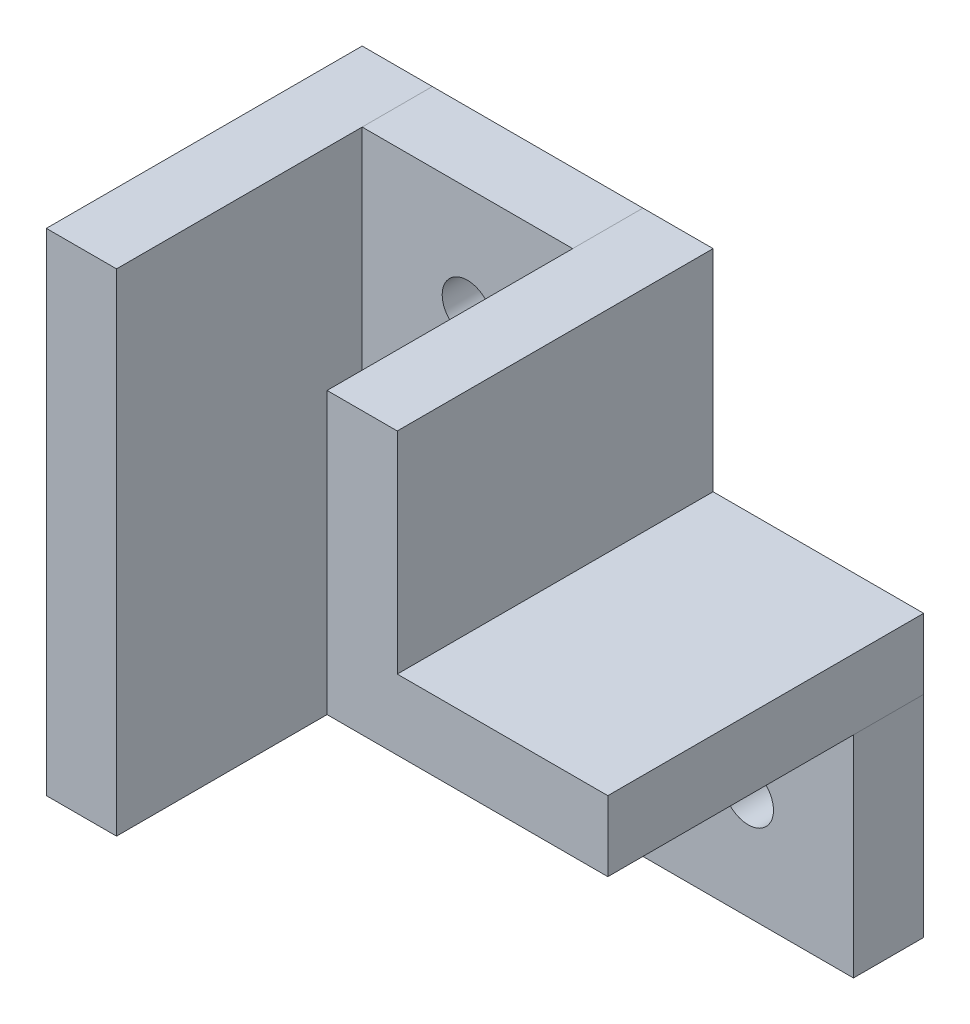
ISO-10303-21;
HEADER;
FILE_DESCRIPTION(('STEP AP214'),'2;1');
FILE_NAME('part.step','',(''),(''),'','','');
FILE_SCHEMA(('AUTOMOTIVE_DESIGN { 1 0 10303 214 1 1 1 1 }'));
ENDSEC;
DATA;
#1=APPLICATION_CONTEXT('core data for automotive mechanical design processes');
#2=APPLICATION_PROTOCOL_DEFINITION('international standard','automotive_design',2000,#1);
#3=PRODUCT_CONTEXT('',#1,'mechanical');
#4=PRODUCT('Part','Part','',(#3));
#5=PRODUCT_RELATED_PRODUCT_CATEGORY('part','',(#4));
#6=PRODUCT_DEFINITION_FORMATION('','',#4);
#7=PRODUCT_DEFINITION_CONTEXT('part definition',#1,'design');
#8=PRODUCT_DEFINITION('design','',#6,#7);
#9=PRODUCT_DEFINITION_SHAPE('','',#8);
#10=(LENGTH_UNIT() NAMED_UNIT(*) SI_UNIT(.MILLI.,.METRE.));
#11=(NAMED_UNIT(*) PLANE_ANGLE_UNIT() SI_UNIT($,.RADIAN.));
#12=(NAMED_UNIT(*) SI_UNIT($,.STERADIAN.) SOLID_ANGLE_UNIT());
#13=UNCERTAINTY_MEASURE_WITH_UNIT(LENGTH_MEASURE(1.E-05),#10,'distance_accuracy_value','');
#14=(GEOMETRIC_REPRESENTATION_CONTEXT(3) GLOBAL_UNCERTAINTY_ASSIGNED_CONTEXT((#13)) GLOBAL_UNIT_ASSIGNED_CONTEXT((#10,
#11,#12)) REPRESENTATION_CONTEXT('',''));
#15=CARTESIAN_POINT('',(0.,0.,0.));
#16=DIRECTION('',(0.,0.,1.));
#17=DIRECTION('',(1.,0.,0.));
#18=AXIS2_PLACEMENT_3D('',#15,#16,#17);
#19=CARTESIAN_POINT('',(-7.52988047808764,-25.8067729083665,22.5));
#20=DIRECTION('',(1.,0.,0.));
#21=DIRECTION('',(0.,1.,0.));
#22=AXIS2_PLACEMENT_3D('',#19,#20,#21);
#23=PLANE('',#22);
#24=DIRECTION('',(0.,-1.,0.));
#25=VECTOR('',#24,1.);
#26=CARTESIAN_POINT('',(-7.52988047808764,-25.8067729083665,0.));
#27=LINE('',#26,#25);
#28=CARTESIAN_POINT('',(-7.52988047808764,9.19322709163348,0.));
#29=VERTEX_POINT('',#28);
#30=CARTESIAN_POINT('',(-7.52988047808764,-25.8067729083665,0.));
#31=VERTEX_POINT('',#30);
#32=EDGE_CURVE('E110',#29,#31,#27,.T.);
#33=ORIENTED_EDGE('',*,*,#32,.F.);
#34=DIRECTION('',(0.,0.,-1.));
#35=VECTOR('',#34,1.);
#36=CARTESIAN_POINT('',(-7.52988047808764,9.19322709163348,22.5));
#37=LINE('',#36,#35);
#38=CARTESIAN_POINT('',(-7.52988047808764,9.19322709163348,22.5));
#39=VERTEX_POINT('',#38);
#40=EDGE_CURVE('E12',#39,#29,#37,.T.);
#41=ORIENTED_EDGE('',*,*,#40,.F.);
#42=DIRECTION('',(0.,-1.,0.));
#43=VECTOR('',#42,1.);
#44=CARTESIAN_POINT('',(-7.52988047808764,-25.8067729083665,22.5));
#45=LINE('',#44,#43);
#46=CARTESIAN_POINT('',(-7.52988047808764,-25.8067729083665,22.5));
#47=VERTEX_POINT('',#46);
#48=EDGE_CURVE('E104',#39,#47,#45,.T.);
#49=ORIENTED_EDGE('',*,*,#48,.T.);
#50=DIRECTION('',(0.,0.,-1.));
#51=VECTOR('',#50,1.);
#52=CARTESIAN_POINT('',(-7.52988047808764,-25.8067729083665,22.5));
#53=LINE('',#52,#51);
#54=EDGE_CURVE('E49',#47,#31,#53,.T.);
#55=ORIENTED_EDGE('',*,*,#54,.T.);
#56=EDGE_LOOP('',(#33,#41,#49,#55));
#57=FACE_BOUND('',#56,.T.);
#58=ADVANCED_FACE('F46',(#57),#23,.T.);
#59=CARTESIAN_POINT('',(-7.52988047808764,9.19322709163348,22.5));
#60=DIRECTION('',(0.,1.,0.));
#61=DIRECTION('',(0.,0.,1.));
#62=AXIS2_PLACEMENT_3D('',#59,#60,#61);
#63=PLANE('',#62);
#64=DIRECTION('',(1.,0.,0.));
#65=VECTOR('',#64,1.);
#66=CARTESIAN_POINT('',(-7.52988047808764,9.19322709163348,0.));
#67=LINE('',#66,#65);
#68=CARTESIAN_POINT('',(-12.5298804780876,9.19322709163348,0.));
#69=VERTEX_POINT('',#68);
#70=EDGE_CURVE('E106',#69,#29,#67,.T.);
#71=ORIENTED_EDGE('',*,*,#70,.F.);
#72=DIRECTION('',(0.,0.,-1.));
#73=VECTOR('',#72,1.);
#74=CARTESIAN_POINT('',(-12.5298804780876,9.19322709163348,22.5));
#75=LINE('',#74,#73);
#76=CARTESIAN_POINT('',(-12.5298804780876,9.19322709163348,22.5));
#77=VERTEX_POINT('',#76);
#78=EDGE_CURVE('E55',#77,#69,#75,.T.);
#79=ORIENTED_EDGE('',*,*,#78,.F.);
#80=DIRECTION('',(1.,0.,0.));
#81=VECTOR('',#80,1.);
#82=CARTESIAN_POINT('',(-7.52988047808764,9.19322709163348,22.5));
#83=LINE('',#82,#81);
#84=EDGE_CURVE('E101',#77,#39,#83,.T.);
#85=ORIENTED_EDGE('',*,*,#84,.T.);
#86=ORIENTED_EDGE('',*,*,#40,.T.);
#87=EDGE_LOOP('',(#71,#79,#85,#86));
#88=FACE_BOUND('',#87,.T.);
#89=ADVANCED_FACE('F120',(#88),#63,.T.);
#90=CARTESIAN_POINT('',(-12.5298804780876,-25.8067729083665,22.5));
#91=DIRECTION('',(-1.,0.,0.));
#92=DIRECTION('',(0.,0.,1.));
#93=AXIS2_PLACEMENT_3D('',#90,#91,#92);
#94=PLANE('',#93);
#95=DIRECTION('',(0.,1.,0.));
#96=VECTOR('',#95,1.);
#97=CARTESIAN_POINT('',(-12.5298804780876,-25.8067729083665,0.));
#98=LINE('',#97,#96);
#99=CARTESIAN_POINT('',(-12.5298804780876,-25.8067729083665,0.));
#100=VERTEX_POINT('',#99);
#101=EDGE_CURVE('E96',#100,#69,#98,.T.);
#102=ORIENTED_EDGE('',*,*,#101,.F.);
#103=DIRECTION('',(0.,0.,-1.));
#104=VECTOR('',#103,1.);
#105=CARTESIAN_POINT('',(-12.5298804780876,-25.8067729083665,22.5));
#106=LINE('',#105,#104);
#107=CARTESIAN_POINT('',(-12.5298804780876,-25.8067729083665,22.5));
#108=VERTEX_POINT('',#107);
#109=EDGE_CURVE('E91',#108,#100,#106,.T.);
#110=ORIENTED_EDGE('',*,*,#109,.F.);
#111=DIRECTION('',(0.,1.,0.));
#112=VECTOR('',#111,1.);
#113=CARTESIAN_POINT('',(-12.5298804780876,-25.8067729083665,22.5));
#114=LINE('',#113,#112);
#115=EDGE_CURVE('E94',#108,#77,#114,.T.);
#116=ORIENTED_EDGE('',*,*,#115,.T.);
#117=ORIENTED_EDGE('',*,*,#78,.T.);
#118=EDGE_LOOP('',(#102,#110,#116,#117));
#119=FACE_BOUND('',#118,.T.);
#120=ADVANCED_FACE('F93',(#119),#94,.T.);
#121=CARTESIAN_POINT('',(-7.52988047808764,-25.8067729083665,22.5));
#122=DIRECTION('',(0.,-1.,0.));
#123=DIRECTION('',(0.,0.,-1.));
#124=AXIS2_PLACEMENT_3D('',#121,#122,#123);
#125=PLANE('',#124);
#126=DIRECTION('',(-1.,0.,0.));
#127=VECTOR('',#126,1.);
#128=CARTESIAN_POINT('',(-7.52988047808764,-25.8067729083665,0.));
#129=LINE('',#128,#127);
#130=EDGE_CURVE('E113',#31,#100,#129,.T.);
#131=ORIENTED_EDGE('',*,*,#130,.F.);
#132=ORIENTED_EDGE('',*,*,#54,.F.);
#133=DIRECTION('',(-1.,0.,0.));
#134=VECTOR('',#133,1.);
#135=CARTESIAN_POINT('',(-7.52988047808764,-25.8067729083665,22.5));
#136=LINE('',#135,#134);
#137=EDGE_CURVE('E100',#47,#108,#136,.T.);
#138=ORIENTED_EDGE('',*,*,#137,.T.);
#139=ORIENTED_EDGE('',*,*,#109,.T.);
#140=EDGE_LOOP('',(#131,#132,#138,#139));
#141=FACE_BOUND('',#140,.T.);
#142=ADVANCED_FACE('F103',(#141),#125,.T.);
#143=CARTESIAN_POINT('',(0.,0.,22.5));
#144=DIRECTION('',(0.,0.,1.));
#145=DIRECTION('',(1.,0.,0.));
#146=AXIS2_PLACEMENT_3D('',#143,#144,#145);
#147=PLANE('',#146);
#148=ORIENTED_EDGE('',*,*,#48,.F.);
#149=ORIENTED_EDGE('',*,*,#84,.F.);
#150=ORIENTED_EDGE('',*,*,#115,.F.);
#151=ORIENTED_EDGE('',*,*,#137,.F.);
#152=EDGE_LOOP('',(#148,#149,#150,#151));
#153=FACE_BOUND('',#152,.T.);
#154=ADVANCED_FACE('F99',(#153),#147,.T.);
#155=CARTESIAN_POINT('',(0.,0.,0.));
#156=DIRECTION('',(0.,0.,1.));
#157=DIRECTION('',(1.,0.,0.));
#158=AXIS2_PLACEMENT_3D('',#155,#156,#157);
#159=PLANE('',#158);
#160=ORIENTED_EDGE('',*,*,#32,.T.);
#161=ORIENTED_EDGE('',*,*,#130,.T.);
#162=ORIENTED_EDGE('',*,*,#101,.T.);
#163=ORIENTED_EDGE('',*,*,#70,.T.);
#164=EDGE_LOOP('',(#160,#161,#162,#163));
#165=FACE_BOUND('',#164,.T.);
#166=ADVANCED_FACE('F119',(#165),#159,.F.);
#167=CLOSED_SHELL('',(#58,#89,#120,#142,#154,#166));
#168=MANIFOLD_SOLID_BREP('B2',#167);
#169=CARTESIAN_POINT('',(7.47011952191236,-10.8067729083665,22.5));
#170=DIRECTION('',(-1.,0.,0.));
#171=DIRECTION('',(0.,-1.,0.));
#172=AXIS2_PLACEMENT_3D('',#169,#170,#171);
#173=PLANE('',#172);
#174=DIRECTION('',(0.,1.,0.));
#175=VECTOR('',#174,1.);
#176=CARTESIAN_POINT('',(7.47011952191236,-10.8067729083665,0.));
#177=LINE('',#176,#175);
#178=CARTESIAN_POINT('',(7.47011952191236,-10.8067729083665,0.));
#179=VERTEX_POINT('',#178);
#180=CARTESIAN_POINT('',(7.47011952191236,9.19322709163348,0.));
#181=VERTEX_POINT('',#180);
#182=EDGE_CURVE('E264',#179,#181,#177,.T.);
#183=ORIENTED_EDGE('',*,*,#182,.F.);
#184=DIRECTION('',(0.,0.,-1.));
#185=VECTOR('',#184,1.);
#186=CARTESIAN_POINT('',(7.47011952191236,-10.8067729083665,22.5));
#187=LINE('',#186,#185);
#188=CARTESIAN_POINT('',(7.47011952191236,-10.8067729083665,22.5));
#189=VERTEX_POINT('',#188);
#190=EDGE_CURVE('E44',#189,#179,#187,.T.);
#191=ORIENTED_EDGE('',*,*,#190,.F.);
#192=DIRECTION('',(0.,1.,0.));
#193=VECTOR('',#192,1.);
#194=CARTESIAN_POINT('',(7.47011952191236,-10.8067729083665,22.5));
#195=LINE('',#194,#193);
#196=CARTESIAN_POINT('',(7.47011952191236,9.19322709163348,22.5));
#197=VERTEX_POINT('',#196);
#198=EDGE_CURVE('E278',#189,#197,#195,.T.);
#199=ORIENTED_EDGE('',*,*,#198,.T.);
#200=DIRECTION('',(0.,0.,-1.));
#201=VECTOR('',#200,1.);
#202=CARTESIAN_POINT('',(7.47011952191236,9.19322709163348,22.5));
#203=LINE('',#202,#201);
#204=EDGE_CURVE('E182',#197,#181,#203,.T.);
#205=ORIENTED_EDGE('',*,*,#204,.T.);
#206=EDGE_LOOP('',(#183,#191,#199,#205));
#207=FACE_BOUND('',#206,.T.);
#208=ADVANCED_FACE('F179',(#207),#173,.T.);
#209=CARTESIAN_POINT('',(27.4701195219124,-10.8067729083665,22.5));
#210=DIRECTION('',(0.,-1.,0.));
#211=DIRECTION('',(1.,0.,0.));
#212=AXIS2_PLACEMENT_3D('',#209,#210,#211);
#213=PLANE('',#212);
#214=DIRECTION('',(-1.,0.,0.));
#215=VECTOR('',#214,1.);
#216=CARTESIAN_POINT('',(27.4701195219124,-10.8067729083665,0.));
#217=LINE('',#216,#215);
#218=CARTESIAN_POINT('',(27.4701195219124,-10.8067729083665,0.));
#219=VERTEX_POINT('',#218);
#220=EDGE_CURVE('E276',#219,#179,#217,.T.);
#221=ORIENTED_EDGE('',*,*,#220,.F.);
#222=DIRECTION('',(0.,0.,-1.));
#223=VECTOR('',#222,1.);
#224=CARTESIAN_POINT('',(27.4701195219124,-10.8067729083665,22.5));
#225=LINE('',#224,#223);
#226=CARTESIAN_POINT('',(27.4701195219124,-10.8067729083665,22.5));
#227=VERTEX_POINT('',#226);
#228=EDGE_CURVE('E188',#227,#219,#225,.T.);
#229=ORIENTED_EDGE('',*,*,#228,.F.);
#230=DIRECTION('',(-1.,0.,0.));
#231=VECTOR('',#230,1.);
#232=CARTESIAN_POINT('',(27.4701195219124,-10.8067729083665,22.5));
#233=LINE('',#232,#231);
#234=EDGE_CURVE('E254',#227,#189,#233,.T.);
#235=ORIENTED_EDGE('',*,*,#234,.T.);
#236=ORIENTED_EDGE('',*,*,#190,.T.);
#237=EDGE_LOOP('',(#221,#229,#235,#236));
#238=FACE_BOUND('',#237,.T.);
#239=ADVANCED_FACE('F286',(#238),#213,.T.);
#240=CARTESIAN_POINT('',(27.4701195219124,-10.8067729083665,22.5));
#241=DIRECTION('',(1.,0.,0.));
#242=DIRECTION('',(0.,0.,-1.));
#243=AXIS2_PLACEMENT_3D('',#240,#241,#242);
#244=PLANE('',#243);
#245=DIRECTION('',(0.,-1.,0.));
#246=VECTOR('',#245,1.);
#247=CARTESIAN_POINT('',(27.4701195219124,-10.8067729083665,0.));
#248=LINE('',#247,#246);
#249=CARTESIAN_POINT('',(27.4701195219124,-5.80677290836653,0.));
#250=VERTEX_POINT('',#249);
#251=EDGE_CURVE('E241',#250,#219,#248,.T.);
#252=ORIENTED_EDGE('',*,*,#251,.F.);
#253=DIRECTION('',(0.,0.,-1.));
#254=VECTOR('',#253,1.);
#255=CARTESIAN_POINT('',(27.4701195219124,-5.80677290836653,22.5));
#256=LINE('',#255,#254);
#257=CARTESIAN_POINT('',(27.4701195219124,-5.80677290836653,22.5));
#258=VERTEX_POINT('',#257);
#259=EDGE_CURVE('E236',#258,#250,#256,.T.);
#260=ORIENTED_EDGE('',*,*,#259,.F.);
#261=DIRECTION('',(0.,-1.,0.));
#262=VECTOR('',#261,1.);
#263=CARTESIAN_POINT('',(27.4701195219124,-10.8067729083665,22.5));
#264=LINE('',#263,#262);
#265=EDGE_CURVE('E239',#258,#227,#264,.T.);
#266=ORIENTED_EDGE('',*,*,#265,.T.);
#267=ORIENTED_EDGE('',*,*,#228,.T.);
#268=EDGE_LOOP('',(#252,#260,#266,#267));
#269=FACE_BOUND('',#268,.T.);
#270=ADVANCED_FACE('F238',(#269),#244,.T.);
#271=CARTESIAN_POINT('',(12.4701195219124,-5.80677290836653,22.5));
#272=DIRECTION('',(0.,1.,0.));
#273=DIRECTION('',(-1.,0.,0.));
#274=AXIS2_PLACEMENT_3D('',#271,#272,#273);
#275=PLANE('',#274);
#276=DIRECTION('',(1.,0.,0.));
#277=VECTOR('',#276,1.);
#278=CARTESIAN_POINT('',(12.4701195219124,-5.80677290836653,0.));
#279=LINE('',#278,#277);
#280=CARTESIAN_POINT('',(12.4701195219124,-5.80677290836653,0.));
#281=VERTEX_POINT('',#280);
#282=EDGE_CURVE('E273',#281,#250,#279,.T.);
#283=ORIENTED_EDGE('',*,*,#282,.F.);
#284=DIRECTION('',(0.,0.,-1.));
#285=VECTOR('',#284,1.);
#286=CARTESIAN_POINT('',(12.4701195219124,-5.80677290836653,22.5));
#287=LINE('',#286,#285);
#288=CARTESIAN_POINT('',(12.4701195219124,-5.80677290836653,22.5));
#289=VERTEX_POINT('',#288);
#290=EDGE_CURVE('E246',#289,#281,#287,.T.);
#291=ORIENTED_EDGE('',*,*,#290,.F.);
#292=DIRECTION('',(1.,0.,0.));
#293=VECTOR('',#292,1.);
#294=CARTESIAN_POINT('',(12.4701195219124,-5.80677290836653,22.5));
#295=LINE('',#294,#293);
#296=EDGE_CURVE('E252',#289,#258,#295,.T.);
#297=ORIENTED_EDGE('',*,*,#296,.T.);
#298=ORIENTED_EDGE('',*,*,#259,.T.);
#299=EDGE_LOOP('',(#283,#291,#297,#298));
#300=FACE_BOUND('',#299,.T.);
#301=ADVANCED_FACE('F256',(#300),#275,.T.);
#302=CARTESIAN_POINT('',(12.4701195219124,9.19322709163348,22.5));
#303=DIRECTION('',(1.,0.,0.));
#304=DIRECTION('',(0.,1.,0.));
#305=AXIS2_PLACEMENT_3D('',#302,#303,#304);
#306=PLANE('',#305);
#307=DIRECTION('',(0.,-1.,0.));
#308=VECTOR('',#307,1.);
#309=CARTESIAN_POINT('',(12.4701195219124,9.19322709163348,0.));
#310=LINE('',#309,#308);
#311=CARTESIAN_POINT('',(12.4701195219124,9.19322709163348,0.));
#312=VERTEX_POINT('',#311);
#313=EDGE_CURVE('E270',#312,#281,#310,.T.);
#314=ORIENTED_EDGE('',*,*,#313,.F.);
#315=DIRECTION('',(0.,0.,-1.));
#316=VECTOR('',#315,1.);
#317=CARTESIAN_POINT('',(12.4701195219124,9.19322709163348,22.5));
#318=LINE('',#317,#316);
#319=CARTESIAN_POINT('',(12.4701195219124,9.19322709163348,22.5));
#320=VERTEX_POINT('',#319);
#321=EDGE_CURVE('E281',#320,#312,#318,.T.);
#322=ORIENTED_EDGE('',*,*,#321,.F.);
#323=DIRECTION('',(0.,-1.,0.));
#324=VECTOR('',#323,1.);
#325=CARTESIAN_POINT('',(12.4701195219124,9.19322709163348,22.5));
#326=LINE('',#325,#324);
#327=EDGE_CURVE('E257',#320,#289,#326,.T.);
#328=ORIENTED_EDGE('',*,*,#327,.T.);
#329=ORIENTED_EDGE('',*,*,#290,.T.);
#330=EDGE_LOOP('',(#314,#322,#328,#329));
#331=FACE_BOUND('',#330,.T.);
#332=ADVANCED_FACE('F299',(#331),#306,.T.);
#333=CARTESIAN_POINT('',(7.47011952191236,9.19322709163348,22.5));
#334=DIRECTION('',(0.,1.,0.));
#335=DIRECTION('',(0.,0.,1.));
#336=AXIS2_PLACEMENT_3D('',#333,#334,#335);
#337=PLANE('',#336);
#338=DIRECTION('',(1.,0.,0.));
#339=VECTOR('',#338,1.);
#340=CARTESIAN_POINT('',(7.47011952191236,9.19322709163348,0.));
#341=LINE('',#340,#339);
#342=EDGE_CURVE('E267',#181,#312,#341,.T.);
#343=ORIENTED_EDGE('',*,*,#342,.F.);
#344=ORIENTED_EDGE('',*,*,#204,.F.);
#345=DIRECTION('',(1.,0.,0.));
#346=VECTOR('',#345,1.);
#347=CARTESIAN_POINT('',(7.47011952191236,9.19322709163348,22.5));
#348=LINE('',#347,#346);
#349=EDGE_CURVE('E259',#197,#320,#348,.T.);
#350=ORIENTED_EDGE('',*,*,#349,.T.);
#351=ORIENTED_EDGE('',*,*,#321,.T.);
#352=EDGE_LOOP('',(#343,#344,#350,#351));
#353=FACE_BOUND('',#352,.T.);
#354=ADVANCED_FACE('F283',(#353),#337,.T.);
#355=CARTESIAN_POINT('',(0.,0.,22.5));
#356=DIRECTION('',(0.,0.,-1.));
#357=DIRECTION('',(-1.,0.,0.));
#358=AXIS2_PLACEMENT_3D('',#355,#356,#357);
#359=PLANE('',#358);
#360=ORIENTED_EDGE('',*,*,#198,.F.);
#361=ORIENTED_EDGE('',*,*,#234,.F.);
#362=ORIENTED_EDGE('',*,*,#265,.F.);
#363=ORIENTED_EDGE('',*,*,#296,.F.);
#364=ORIENTED_EDGE('',*,*,#327,.F.);
#365=ORIENTED_EDGE('',*,*,#349,.F.);
#366=EDGE_LOOP('',(#360,#361,#362,#363,#364,#365));
#367=FACE_BOUND('',#366,.T.);
#368=ADVANCED_FACE('F250',(#367),#359,.F.);
#369=CARTESIAN_POINT('',(0.,0.,0.));
#370=DIRECTION('',(0.,0.,-1.));
#371=DIRECTION('',(-1.,0.,0.));
#372=AXIS2_PLACEMENT_3D('',#369,#370,#371);
#373=PLANE('',#372);
#374=ORIENTED_EDGE('',*,*,#182,.T.);
#375=ORIENTED_EDGE('',*,*,#342,.T.);
#376=ORIENTED_EDGE('',*,*,#313,.T.);
#377=ORIENTED_EDGE('',*,*,#282,.T.);
#378=ORIENTED_EDGE('',*,*,#251,.T.);
#379=ORIENTED_EDGE('',*,*,#220,.T.);
#380=EDGE_LOOP('',(#374,#375,#376,#377,#378,#379));
#381=FACE_BOUND('',#380,.T.);
#382=ADVANCED_FACE('F285',(#381),#373,.T.);
#383=CLOSED_SHELL('',(#208,#239,#270,#301,#332,#354,#368,#382));
#384=MANIFOLD_SOLID_BREP('B6',#383);
#385=CARTESIAN_POINT('',(-7.52988047808764,9.19322709163348,5.));
#386=DIRECTION('',(1.,0.,0.));
#387=DIRECTION('',(0.,1.,0.));
#388=AXIS2_PLACEMENT_3D('',#385,#386,#387);
#389=PLANE('',#388);
#390=DIRECTION('',(0.,-1.,0.));
#391=VECTOR('',#390,1.);
#392=CARTESIAN_POINT('',(-7.52988047808764,9.19322709163348,0.));
#393=LINE('',#392,#391);
#394=CARTESIAN_POINT('',(-7.52988047808764,9.19322709163348,0.));
#395=VERTEX_POINT('',#394);
#396=CARTESIAN_POINT('',(-7.52988047808764,-25.8067729083665,0.));
#397=VERTEX_POINT('',#396);
#398=EDGE_CURVE('E439',#395,#397,#393,.T.);
#399=ORIENTED_EDGE('',*,*,#398,.T.);
#400=DIRECTION('',(0.,0.,-1.));
#401=VECTOR('',#400,1.);
#402=CARTESIAN_POINT('',(-7.52988047808764,-25.8067729083665,5.));
#403=LINE('',#402,#401);
#404=CARTESIAN_POINT('',(-7.52988047808764,-25.8067729083665,5.));
#405=VERTEX_POINT('',#404);
#406=EDGE_CURVE('E177',#405,#397,#403,.T.);
#407=ORIENTED_EDGE('',*,*,#406,.F.);
#408=DIRECTION('',(0.,-1.,0.));
#409=VECTOR('',#408,1.);
#410=CARTESIAN_POINT('',(-7.52988047808764,9.19322709163348,5.));
#411=LINE('',#410,#409);
#412=CARTESIAN_POINT('',(-7.52988047808764,9.19322709163348,5.));
#413=VERTEX_POINT('',#412);
#414=EDGE_CURVE('E450',#413,#405,#411,.T.);
#415=ORIENTED_EDGE('',*,*,#414,.F.);
#416=DIRECTION('',(0.,0.,-1.));
#417=VECTOR('',#416,1.);
#418=CARTESIAN_POINT('',(-7.52988047808764,9.19322709163348,5.));
#419=LINE('',#418,#417);
#420=EDGE_CURVE('E435',#413,#395,#419,.T.);
#421=ORIENTED_EDGE('',*,*,#420,.T.);
#422=EDGE_LOOP('',(#399,#407,#415,#421));
#423=FACE_BOUND('',#422,.T.);
#424=ADVANCED_FACE('F355',(#423),#389,.F.);
#425=CARTESIAN_POINT('',(-7.52988047808764,-25.8067729083665,5.));
#426=DIRECTION('',(0.,1.,0.));
#427=DIRECTION('',(0.,0.,1.));
#428=AXIS2_PLACEMENT_3D('',#425,#426,#427);
#429=PLANE('',#428);
#430=DIRECTION('',(1.,0.,0.));
#431=VECTOR('',#430,1.);
#432=CARTESIAN_POINT('',(-7.52988047808764,-25.8067729083665,0.));
#433=LINE('',#432,#431);
#434=CARTESIAN_POINT('',(27.4701195219124,-25.8067729083665,0.));
#435=VERTEX_POINT('',#434);
#436=EDGE_CURVE('E442',#397,#435,#433,.T.);
#437=ORIENTED_EDGE('',*,*,#436,.T.);
#438=DIRECTION('',(0.,0.,-1.));
#439=VECTOR('',#438,1.);
#440=CARTESIAN_POINT('',(27.4701195219124,-25.8067729083665,5.));
#441=LINE('',#440,#439);
#442=CARTESIAN_POINT('',(27.4701195219124,-25.8067729083665,5.));
#443=VERTEX_POINT('',#442);
#444=EDGE_CURVE('E363',#443,#435,#441,.T.);
#445=ORIENTED_EDGE('',*,*,#444,.F.);
#446=DIRECTION('',(1.,0.,0.));
#447=VECTOR('',#446,1.);
#448=CARTESIAN_POINT('',(-7.52988047808764,-25.8067729083665,5.));
#449=LINE('',#448,#447);
#450=EDGE_CURVE('E408',#405,#443,#449,.T.);
#451=ORIENTED_EDGE('',*,*,#450,.F.);
#452=ORIENTED_EDGE('',*,*,#406,.T.);
#453=EDGE_LOOP('',(#437,#445,#451,#452));
#454=FACE_BOUND('',#453,.T.);
#455=ADVANCED_FACE('F475',(#454),#429,.F.);
#456=CARTESIAN_POINT('',(27.4701195219124,-25.8067729083665,5.));
#457=DIRECTION('',(-1.,0.,0.));
#458=DIRECTION('',(0.,0.,1.));
#459=AXIS2_PLACEMENT_3D('',#456,#457,#458);
#460=PLANE('',#459);
#461=DIRECTION('',(0.,1.,0.));
#462=VECTOR('',#461,1.);
#463=CARTESIAN_POINT('',(27.4701195219124,-25.8067729083665,0.));
#464=LINE('',#463,#462);
#465=CARTESIAN_POINT('',(27.4701195219124,-10.8067729083665,0.));
#466=VERTEX_POINT('',#465);
#467=EDGE_CURVE('E445',#435,#466,#464,.T.);
#468=ORIENTED_EDGE('',*,*,#467,.T.);
#469=DIRECTION('',(0.,0.,-1.));
#470=VECTOR('',#469,1.);
#471=CARTESIAN_POINT('',(27.4701195219124,-10.8067729083665,5.));
#472=LINE('',#471,#470);
#473=CARTESIAN_POINT('',(27.4701195219124,-10.8067729083665,5.));
#474=VERTEX_POINT('',#473);
#475=EDGE_CURVE('E430',#474,#466,#472,.T.);
#476=ORIENTED_EDGE('',*,*,#475,.F.);
#477=DIRECTION('',(0.,1.,0.));
#478=VECTOR('',#477,1.);
#479=CARTESIAN_POINT('',(27.4701195219124,-25.8067729083665,5.));
#480=LINE('',#479,#478);
#481=EDGE_CURVE('E421',#443,#474,#480,.T.);
#482=ORIENTED_EDGE('',*,*,#481,.F.);
#483=ORIENTED_EDGE('',*,*,#444,.T.);
#484=EDGE_LOOP('',(#468,#476,#482,#483));
#485=FACE_BOUND('',#484,.T.);
#486=ADVANCED_FACE('F456',(#485),#460,.F.);
#487=CARTESIAN_POINT('',(27.4701195219124,-10.8067729083665,5.));
#488=DIRECTION('',(0.,-1.,0.));
#489=DIRECTION('',(1.,0.,0.));
#490=AXIS2_PLACEMENT_3D('',#487,#488,#489);
#491=PLANE('',#490);
#492=DIRECTION('',(-1.,0.,0.));
#493=VECTOR('',#492,1.);
#494=CARTESIAN_POINT('',(27.4701195219124,-10.8067729083665,0.));
#495=LINE('',#494,#493);
#496=CARTESIAN_POINT('',(7.47011952191236,-10.8067729083665,0.));
#497=VERTEX_POINT('',#496);
#498=EDGE_CURVE('E429',#466,#497,#495,.T.);
#499=ORIENTED_EDGE('',*,*,#498,.T.);
#500=DIRECTION('',(0.,0.,-1.));
#501=VECTOR('',#500,1.);
#502=CARTESIAN_POINT('',(7.47011952191236,-10.8067729083665,5.));
#503=LINE('',#502,#501);
#504=CARTESIAN_POINT('',(7.47011952191236,-10.8067729083665,5.));
#505=VERTEX_POINT('',#504);
#506=EDGE_CURVE('E426',#505,#497,#503,.T.);
#507=ORIENTED_EDGE('',*,*,#506,.F.);
#508=DIRECTION('',(-1.,0.,0.));
#509=VECTOR('',#508,1.);
#510=CARTESIAN_POINT('',(27.4701195219124,-10.8067729083665,5.));
#511=LINE('',#510,#509);
#512=EDGE_CURVE('E415',#474,#505,#511,.T.);
#513=ORIENTED_EDGE('',*,*,#512,.F.);
#514=ORIENTED_EDGE('',*,*,#475,.T.);
#515=EDGE_LOOP('',(#499,#507,#513,#514));
#516=FACE_BOUND('',#515,.T.);
#517=ADVANCED_FACE('F427',(#516),#491,.F.);
#518=CARTESIAN_POINT('',(7.47011952191236,9.19322709163348,5.));
#519=DIRECTION('',(-1.,0.,0.));
#520=DIRECTION('',(0.,-1.,0.));
#521=AXIS2_PLACEMENT_3D('',#518,#519,#520);
#522=PLANE('',#521);
#523=DIRECTION('',(0.,1.,0.));
#524=VECTOR('',#523,1.);
#525=CARTESIAN_POINT('',(7.47011952191236,9.19322709163348,0.));
#526=LINE('',#525,#524);
#527=CARTESIAN_POINT('',(7.47011952191236,9.19322709163348,0.));
#528=VERTEX_POINT('',#527);
#529=EDGE_CURVE('E394',#497,#528,#526,.T.);
#530=ORIENTED_EDGE('',*,*,#529,.T.);
#531=DIRECTION('',(0.,0.,-1.));
#532=VECTOR('',#531,1.);
#533=CARTESIAN_POINT('',(7.47011952191236,9.19322709163348,5.));
#534=LINE('',#533,#532);
#535=CARTESIAN_POINT('',(7.47011952191236,9.19322709163348,5.));
#536=VERTEX_POINT('',#535);
#537=EDGE_CURVE('E431',#536,#528,#534,.T.);
#538=ORIENTED_EDGE('',*,*,#537,.F.);
#539=DIRECTION('',(0.,1.,0.));
#540=VECTOR('',#539,1.);
#541=CARTESIAN_POINT('',(7.47011952191236,9.19322709163348,5.));
#542=LINE('',#541,#540);
#543=EDGE_CURVE('E419',#505,#536,#542,.T.);
#544=ORIENTED_EDGE('',*,*,#543,.F.);
#545=ORIENTED_EDGE('',*,*,#506,.T.);
#546=EDGE_LOOP('',(#530,#538,#544,#545));
#547=FACE_BOUND('',#546,.T.);
#548=ADVANCED_FACE('F433',(#547),#522,.F.);
#549=CARTESIAN_POINT('',(-7.52988047808764,9.19322709163348,5.));
#550=DIRECTION('',(0.,-1.,0.));
#551=DIRECTION('',(0.,0.,-1.));
#552=AXIS2_PLACEMENT_3D('',#549,#550,#551);
#553=PLANE('',#552);
#554=DIRECTION('',(-1.,0.,0.));
#555=VECTOR('',#554,1.);
#556=CARTESIAN_POINT('',(-7.52988047808764,9.19322709163348,0.));
#557=LINE('',#556,#555);
#558=EDGE_CURVE('E400',#528,#395,#557,.T.);
#559=ORIENTED_EDGE('',*,*,#558,.T.);
#560=ORIENTED_EDGE('',*,*,#420,.F.);
#561=DIRECTION('',(-1.,0.,0.));
#562=VECTOR('',#561,1.);
#563=CARTESIAN_POINT('',(-7.52988047808764,9.19322709163348,5.));
#564=LINE('',#563,#562);
#565=EDGE_CURVE('E371',#536,#413,#564,.T.);
#566=ORIENTED_EDGE('',*,*,#565,.F.);
#567=ORIENTED_EDGE('',*,*,#537,.T.);
#568=EDGE_LOOP('',(#559,#560,#566,#567));
#569=FACE_BOUND('',#568,.T.);
#570=ADVANCED_FACE('F463',(#569),#553,.F.);
#571=CARTESIAN_POINT('',(0.,0.,5.));
#572=DIRECTION('',(0.,0.,1.));
#573=DIRECTION('',(1.,0.,0.));
#574=AXIS2_PLACEMENT_3D('',#571,#572,#573);
#575=PLANE('',#574);
#576=CARTESIAN_POINT('',(-0.0298804780876419,1.69322709163348,5.));
#577=DIRECTION('',(0.,0.,1.));
#578=DIRECTION('',(1.,0.,0.));
#579=AXIS2_PLACEMENT_3D('',#576,#577,#578);
#580=CIRCLE('',#579,1.8);
#581=CARTESIAN_POINT('',(1.77011952191236,1.69322709163348,5.));
#582=VERTEX_POINT('',#581);
#583=EDGE_CURVE('E443',#582,#582,#580,.T.);
#584=ORIENTED_EDGE('',*,*,#583,.F.);
#585=EDGE_LOOP('',(#584));
#586=FACE_BOUND('',#585,.T.);
#587=CARTESIAN_POINT('',(19.9701195219124,-18.3067729083665,5.));
#588=DIRECTION('',(0.,0.,1.));
#589=DIRECTION('',(1.,0.,0.));
#590=AXIS2_PLACEMENT_3D('',#587,#588,#589);
#591=CIRCLE('',#590,1.8);
#592=CARTESIAN_POINT('',(21.7701195219124,-18.3067729083665,5.));
#593=VERTEX_POINT('',#592);
#594=EDGE_CURVE('E541',#593,#593,#591,.T.);
#595=ORIENTED_EDGE('',*,*,#594,.F.);
#596=EDGE_LOOP('',(#595));
#597=FACE_BOUND('',#596,.T.);
#598=ORIENTED_EDGE('',*,*,#414,.T.);
#599=ORIENTED_EDGE('',*,*,#450,.T.);
#600=ORIENTED_EDGE('',*,*,#481,.T.);
#601=ORIENTED_EDGE('',*,*,#512,.T.);
#602=ORIENTED_EDGE('',*,*,#543,.T.);
#603=ORIENTED_EDGE('',*,*,#565,.T.);
#604=EDGE_LOOP('',(#598,#599,#600,#601,#602,#603));
#605=FACE_BOUND('',#604,.T.);
#606=ADVANCED_FACE('F417',(#586,#597,#605),#575,.T.);
#607=CARTESIAN_POINT('',(0.,0.,0.));
#608=DIRECTION('',(0.,0.,1.));
#609=DIRECTION('',(1.,0.,0.));
#610=AXIS2_PLACEMENT_3D('',#607,#608,#609);
#611=PLANE('',#610);
#612=CARTESIAN_POINT('',(-0.0298804780876419,1.69322709163348,0.));
#613=DIRECTION('',(0.,0.,-1.));
#614=DIRECTION('',(-1.,0.,0.));
#615=AXIS2_PLACEMENT_3D('',#612,#613,#614);
#616=CIRCLE('',#615,1.8);
#617=CARTESIAN_POINT('',(-1.82988047808764,1.69322709163348,0.));
#618=VERTEX_POINT('',#617);
#619=EDGE_CURVE('E540',#618,#618,#616,.T.);
#620=ORIENTED_EDGE('',*,*,#619,.F.);
#621=EDGE_LOOP('',(#620));
#622=FACE_BOUND('',#621,.T.);
#623=CARTESIAN_POINT('',(19.9701195219124,-18.3067729083665,0.));
#624=DIRECTION('',(0.,0.,-1.));
#625=DIRECTION('',(-1.,0.,0.));
#626=AXIS2_PLACEMENT_3D('',#623,#624,#625);
#627=CIRCLE('',#626,1.8);
#628=CARTESIAN_POINT('',(18.1701195219124,-18.3067729083665,0.));
#629=VERTEX_POINT('',#628);
#630=EDGE_CURVE('E542',#629,#629,#627,.T.);
#631=ORIENTED_EDGE('',*,*,#630,.F.);
#632=EDGE_LOOP('',(#631));
#633=FACE_BOUND('',#632,.T.);
#634=ORIENTED_EDGE('',*,*,#398,.F.);
#635=ORIENTED_EDGE('',*,*,#558,.F.);
#636=ORIENTED_EDGE('',*,*,#529,.F.);
#637=ORIENTED_EDGE('',*,*,#498,.F.);
#638=ORIENTED_EDGE('',*,*,#467,.F.);
#639=ORIENTED_EDGE('',*,*,#436,.F.);
#640=EDGE_LOOP('',(#634,#635,#636,#637,#638,#639));
#641=FACE_BOUND('',#640,.T.);
#642=ADVANCED_FACE('F459',(#622,#633,#641),#611,.F.);
#643=CARTESIAN_POINT('',(19.9701195219124,-18.3067729083665,22.5));
#644=DIRECTION('',(0.,0.,-1.));
#645=DIRECTION('',(-1.,0.,0.));
#646=AXIS2_PLACEMENT_3D('',#643,#644,#645);
#647=CYLINDRICAL_SURFACE('',#646,1.8);
#648=ORIENTED_EDGE('',*,*,#594,.T.);
#649=EDGE_LOOP('',(#648));
#650=FACE_BOUND('',#649,.T.);
#651=ORIENTED_EDGE('',*,*,#630,.T.);
#652=EDGE_LOOP('',(#651));
#653=FACE_BOUND('',#652,.T.);
#654=ADVANCED_FACE('F512',(#650,#653),#647,.F.);
#655=CARTESIAN_POINT('',(-0.0298804780876419,1.69322709163348,22.5));
#656=DIRECTION('',(0.,0.,-1.));
#657=DIRECTION('',(-1.,0.,0.));
#658=AXIS2_PLACEMENT_3D('',#655,#656,#657);
#659=CYLINDRICAL_SURFACE('',#658,1.8);
#660=ORIENTED_EDGE('',*,*,#583,.T.);
#661=EDGE_LOOP('',(#660));
#662=FACE_BOUND('',#661,.T.);
#663=ORIENTED_EDGE('',*,*,#619,.T.);
#664=EDGE_LOOP('',(#663));
#665=FACE_BOUND('',#664,.T.);
#666=ADVANCED_FACE('F521',(#662,#665),#659,.F.);
#667=CLOSED_SHELL('',(#424,#455,#486,#517,#548,#570,#606,#642,#654,#666));
#668=MANIFOLD_SOLID_BREP('B38',#667);
#669=ADVANCED_BREP_SHAPE_REPRESENTATION('',(#18,#168,#384,#668),#14);
#670=SHAPE_DEFINITION_REPRESENTATION(#9,#669);
ENDSEC;
END-ISO-10303-21;
